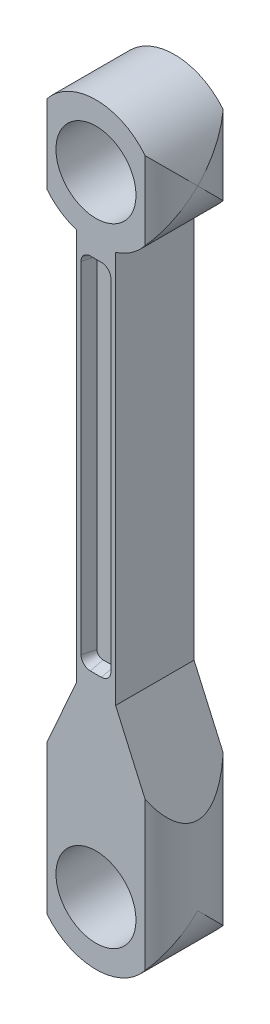
ISO-10303-21;
HEADER;
FILE_DESCRIPTION(('STEP AP214'),'2;1');
FILE_NAME('part.step','',(''),(''),'','','');
FILE_SCHEMA(('AUTOMOTIVE_DESIGN { 1 0 10303 214 1 1 1 1 }'));
ENDSEC;
DATA;
#1=APPLICATION_CONTEXT('core data for automotive mechanical design processes');
#2=APPLICATION_PROTOCOL_DEFINITION('international standard','automotive_design',2000,#1);
#3=PRODUCT_CONTEXT('',#1,'mechanical');
#4=PRODUCT('Part','Part','',(#3));
#5=PRODUCT_RELATED_PRODUCT_CATEGORY('part','',(#4));
#6=PRODUCT_DEFINITION_FORMATION('','',#4);
#7=PRODUCT_DEFINITION_CONTEXT('part definition',#1,'design');
#8=PRODUCT_DEFINITION('design','',#6,#7);
#9=PRODUCT_DEFINITION_SHAPE('','',#8);
#10=(LENGTH_UNIT() NAMED_UNIT(*) SI_UNIT(.MILLI.,.METRE.));
#11=(NAMED_UNIT(*) PLANE_ANGLE_UNIT() SI_UNIT($,.RADIAN.));
#12=(NAMED_UNIT(*) SI_UNIT($,.STERADIAN.) SOLID_ANGLE_UNIT());
#13=UNCERTAINTY_MEASURE_WITH_UNIT(LENGTH_MEASURE(1.E-05),#10,'distance_accuracy_value','');
#14=(GEOMETRIC_REPRESENTATION_CONTEXT(3) GLOBAL_UNCERTAINTY_ASSIGNED_CONTEXT((#13)) GLOBAL_UNIT_ASSIGNED_CONTEXT((#10,
#11,#12)) REPRESENTATION_CONTEXT('',''));
#15=CARTESIAN_POINT('',(0.,0.,0.));
#16=DIRECTION('',(0.,0.,1.));
#17=DIRECTION('',(1.,0.,0.));
#18=AXIS2_PLACEMENT_3D('',#15,#16,#17);
#19=CARTESIAN_POINT('',(0.,0.,12.7));
#20=DIRECTION('',(0.,0.,1.));
#21=DIRECTION('',(1.,0.,0.));
#22=AXIS2_PLACEMENT_3D('',#19,#20,#21);
#23=PLANE('',#22);
#24=CARTESIAN_POINT('',(-0.895446970962818,32.766,12.7));
#25=DIRECTION('',(0.,0.,1.));
#26=DIRECTION('',(1.,0.,0.));
#27=AXIS2_PLACEMENT_3D('',#24,#25,#26);
#28=CIRCLE('',#27,1.524);
#29=CARTESIAN_POINT('',(-2.41944697096282,32.766,12.7));
#30=VERTEX_POINT('',#29);
#31=CARTESIAN_POINT('',(-0.895446970962811,31.242,12.7));
#32=VERTEX_POINT('',#31);
#33=EDGE_CURVE('E323',#30,#32,#28,.T.);
#34=ORIENTED_EDGE('',*,*,#33,.F.);
#35=DIRECTION('',(0.,-1.,0.));
#36=VECTOR('',#35,1.);
#37=CARTESIAN_POINT('',(-2.41944697096282,87.884,12.7));
#38=LINE('',#37,#36);
#39=CARTESIAN_POINT('',(-2.41944697096282,87.884,12.7));
#40=VERTEX_POINT('',#39);
#41=EDGE_CURVE('E381',#40,#30,#38,.T.);
#42=ORIENTED_EDGE('',*,*,#41,.F.);
#43=CARTESIAN_POINT('',(-0.895446970962823,87.884,12.7));
#44=DIRECTION('',(0.,0.,1.));
#45=DIRECTION('',(1.,0.,0.));
#46=AXIS2_PLACEMENT_3D('',#43,#44,#45);
#47=CIRCLE('',#46,1.524);
#48=CARTESIAN_POINT('',(-0.895446970962823,89.408,12.7));
#49=VERTEX_POINT('',#48);
#50=EDGE_CURVE('E378',#49,#40,#47,.T.);
#51=ORIENTED_EDGE('',*,*,#50,.F.);
#52=DIRECTION('',(-1.,0.,0.));
#53=VECTOR('',#52,1.);
#54=CARTESIAN_POINT('',(-0.895446970962823,89.408,12.7));
#55=LINE('',#54,#53);
#56=CARTESIAN_POINT('',(0.895446970962823,89.408,12.7));
#57=VERTEX_POINT('',#56);
#58=EDGE_CURVE('E375',#57,#49,#55,.T.);
#59=ORIENTED_EDGE('',*,*,#58,.F.);
#60=CARTESIAN_POINT('',(0.895446970962823,87.884,12.7));
#61=DIRECTION('',(0.,0.,1.));
#62=DIRECTION('',(-1.,0.,0.));
#63=AXIS2_PLACEMENT_3D('',#60,#61,#62);
#64=CIRCLE('',#63,1.524);
#65=CARTESIAN_POINT('',(2.41944697096282,87.884,12.7));
#66=VERTEX_POINT('',#65);
#67=EDGE_CURVE('E372',#66,#57,#64,.T.);
#68=ORIENTED_EDGE('',*,*,#67,.F.);
#69=DIRECTION('',(0.,1.,0.));
#70=VECTOR('',#69,1.);
#71=CARTESIAN_POINT('',(2.41944697096282,87.884,12.7));
#72=LINE('',#71,#70);
#73=CARTESIAN_POINT('',(2.41944697096283,32.766,12.7));
#74=VERTEX_POINT('',#73);
#75=EDGE_CURVE('E369',#74,#66,#72,.T.);
#76=ORIENTED_EDGE('',*,*,#75,.F.);
#77=CARTESIAN_POINT('',(0.89544697096283,32.766,12.7));
#78=DIRECTION('',(0.,0.,1.));
#79=DIRECTION('',(1.,0.,0.));
#80=AXIS2_PLACEMENT_3D('',#77,#78,#79);
#81=CIRCLE('',#80,1.524);
#82=CARTESIAN_POINT('',(0.895446970962818,31.242,12.7));
#83=VERTEX_POINT('',#82);
#84=EDGE_CURVE('E366',#83,#74,#81,.T.);
#85=ORIENTED_EDGE('',*,*,#84,.F.);
#86=DIRECTION('',(1.,0.,0.));
#87=VECTOR('',#86,1.);
#88=CARTESIAN_POINT('',(-0.895446970962807,31.242,12.7));
#89=LINE('',#88,#87);
#90=EDGE_CURVE('E363',#32,#83,#89,.T.);
#91=ORIENTED_EDGE('',*,*,#90,.F.);
#92=EDGE_LOOP('',(#34,#42,#51,#59,#68,#76,#85,#91));
#93=FACE_BOUND('',#92,.T.);
#94=CARTESIAN_POINT('',(0.,0.,12.7));
#95=DIRECTION('',(0.,0.,1.));
#96=DIRECTION('',(1.,0.,0.));
#97=AXIS2_PLACEMENT_3D('',#94,#95,#96);
#98=CIRCLE('',#97,6.47699999999996);
#99=CARTESIAN_POINT('',(6.47699999999996,0.,12.7));
#100=VERTEX_POINT('',#99);
#101=EDGE_CURVE('E432',#100,#100,#98,.T.);
#102=ORIENTED_EDGE('',*,*,#101,.F.);
#103=EDGE_LOOP('',(#102));
#104=FACE_BOUND('',#103,.T.);
#105=CARTESIAN_POINT('',(0.,101.6,12.7));
#106=DIRECTION('',(0.,0.,1.));
#107=DIRECTION('',(1.,0.,0.));
#108=AXIS2_PLACEMENT_3D('',#105,#106,#107);
#109=CIRCLE('',#108,6.477);
#110=CARTESIAN_POINT('',(6.477,101.6,12.7));
#111=VERTEX_POINT('',#110);
#112=EDGE_CURVE('E426',#111,#111,#109,.T.);
#113=ORIENTED_EDGE('',*,*,#112,.F.);
#114=EDGE_LOOP('',(#113));
#115=FACE_BOUND('',#114,.T.);
#116=CARTESIAN_POINT('',(0.,0.,12.7));
#117=DIRECTION('',(0.,0.,1.));
#118=DIRECTION('',(1.,0.,0.));
#119=AXIS2_PLACEMENT_3D('',#116,#117,#118);
#120=CIRCLE('',#119,10.16);
#121=CARTESIAN_POINT('',(-7.96171854377689,-6.31162719349607,12.7));
#122=VERTEX_POINT('',#121);
#123=CARTESIAN_POINT('',(7.96171854377688,-6.31162719349609,12.7));
#124=VERTEX_POINT('',#123);
#125=EDGE_CURVE('E249',#122,#124,#120,.T.);
#126=ORIENTED_EDGE('',*,*,#125,.T.);
#127=DIRECTION('',(0.,1.,0.));
#128=VECTOR('',#127,1.);
#129=CARTESIAN_POINT('',(7.96171854377688,-10.16,12.7));
#130=LINE('',#129,#128);
#131=CARTESIAN_POINT('',(7.96171854377688,17.6607040640885,12.7));
#132=VERTEX_POINT('',#131);
#133=EDGE_CURVE('E256',#124,#132,#130,.T.);
#134=ORIENTED_EDGE('',*,*,#133,.T.);
#135=DIRECTION('',(-0.405141586779863,0.914253955234263,0.));
#136=VECTOR('',#135,1.);
#137=CARTESIAN_POINT('',(10.16,12.7,12.7));
#138=LINE('',#137,#136);
#139=CARTESIAN_POINT('',(3.18144697096282,28.448,12.7));
#140=VERTEX_POINT('',#139);
#141=EDGE_CURVE('E439',#132,#140,#138,.T.);
#142=ORIENTED_EDGE('',*,*,#141,.T.);
#143=DIRECTION('',(0.,1.,0.));
#144=VECTOR('',#143,1.);
#145=CARTESIAN_POINT('',(3.18144697096282,28.448,12.7));
#146=LINE('',#145,#144);
#147=CARTESIAN_POINT('',(3.18144697096282,91.9509588470692,12.7));
#148=VERTEX_POINT('',#147);
#149=EDGE_CURVE('E442',#140,#148,#146,.T.);
#150=ORIENTED_EDGE('',*,*,#149,.T.);
#151=CARTESIAN_POINT('',(0.,101.6,12.7));
#152=DIRECTION('',(0.,0.,1.));
#153=DIRECTION('',(1.,0.,0.));
#154=AXIS2_PLACEMENT_3D('',#151,#152,#153);
#155=CIRCLE('',#154,10.16);
#156=CARTESIAN_POINT('',(7.96171854377688,95.2883728065039,12.7));
#157=VERTEX_POINT('',#156);
#158=EDGE_CURVE('E445',#148,#157,#155,.T.);
#159=ORIENTED_EDGE('',*,*,#158,.T.);
#160=CARTESIAN_POINT('',(7.96171854377688,107.911627193496,12.7));
#161=VERTEX_POINT('',#160);
#162=EDGE_CURVE('E58',#157,#161,#130,.T.);
#163=ORIENTED_EDGE('',*,*,#162,.T.);
#164=CARTESIAN_POINT('',(-7.96171854377688,107.911627193496,12.7));
#165=VERTEX_POINT('',#164);
#166=EDGE_CURVE('E448',#161,#165,#155,.T.);
#167=ORIENTED_EDGE('',*,*,#166,.T.);
#168=DIRECTION('',(0.,1.,0.));
#169=VECTOR('',#168,1.);
#170=CARTESIAN_POINT('',(-7.96171854377688,-10.16,12.7));
#171=LINE('',#170,#169);
#172=CARTESIAN_POINT('',(-7.96171854377688,95.2883728065039,12.7));
#173=VERTEX_POINT('',#172);
#174=EDGE_CURVE('E283',#165,#173,#171,.F.);
#175=ORIENTED_EDGE('',*,*,#174,.T.);
#176=CARTESIAN_POINT('',(-3.18144697096282,91.9509588470692,12.7));
#177=VERTEX_POINT('',#176);
#178=EDGE_CURVE('E444',#173,#177,#155,.T.);
#179=ORIENTED_EDGE('',*,*,#178,.T.);
#180=DIRECTION('',(0.,-1.,0.));
#181=VECTOR('',#180,1.);
#182=CARTESIAN_POINT('',(-3.18144697096282,28.448,12.7));
#183=LINE('',#182,#181);
#184=CARTESIAN_POINT('',(-3.18144697096282,28.448,12.7));
#185=VERTEX_POINT('',#184);
#186=EDGE_CURVE('E447',#177,#185,#183,.T.);
#187=ORIENTED_EDGE('',*,*,#186,.T.);
#188=DIRECTION('',(-0.405141586779863,-0.914253955234263,0.));
#189=VECTOR('',#188,1.);
#190=CARTESIAN_POINT('',(-10.16,12.7,12.7));
#191=LINE('',#190,#189);
#192=CARTESIAN_POINT('',(-7.96171854377688,17.6607040640885,12.7));
#193=VERTEX_POINT('',#192);
#194=EDGE_CURVE('E450',#185,#193,#191,.T.);
#195=ORIENTED_EDGE('',*,*,#194,.T.);
#196=EDGE_CURVE('E252',#193,#122,#171,.F.);
#197=ORIENTED_EDGE('',*,*,#196,.T.);
#198=EDGE_LOOP('',(#126,#134,#142,#150,#159,#163,#167,#175,#179,#187,#195,#197));
#199=FACE_BOUND('',#198,.T.);
#200=ADVANCED_FACE('F35',(#93,#104,#115,#199),#23,.T.);
#201=CARTESIAN_POINT('',(0.,0.,0.));
#202=DIRECTION('',(0.,0.,1.));
#203=DIRECTION('',(1.,0.,0.));
#204=AXIS2_PLACEMENT_3D('',#201,#202,#203);
#205=PLANE('',#204);
#206=DIRECTION('',(-1.,0.,0.));
#207=VECTOR('',#206,1.);
#208=CARTESIAN_POINT('',(0.895446970962805,31.242,0.));
#209=LINE('',#208,#207);
#210=CARTESIAN_POINT('',(0.895446970962809,31.242,0.));
#211=VERTEX_POINT('',#210);
#212=CARTESIAN_POINT('',(-0.895446970962819,31.242,0.));
#213=VERTEX_POINT('',#212);
#214=EDGE_CURVE('E299',#211,#213,#209,.T.);
#215=ORIENTED_EDGE('',*,*,#214,.F.);
#216=CARTESIAN_POINT('',(0.895446970962816,32.766,0.));
#217=DIRECTION('',(0.,0.,-1.));
#218=DIRECTION('',(-1.,0.,0.));
#219=AXIS2_PLACEMENT_3D('',#216,#217,#218);
#220=CIRCLE('',#219,1.524);
#221=CARTESIAN_POINT('',(2.41944697096282,32.766,0.));
#222=VERTEX_POINT('',#221);
#223=EDGE_CURVE('E259',#222,#211,#220,.T.);
#224=ORIENTED_EDGE('',*,*,#223,.F.);
#225=DIRECTION('',(0.,-1.,0.));
#226=VECTOR('',#225,1.);
#227=CARTESIAN_POINT('',(2.41944697096282,87.884,0.));
#228=LINE('',#227,#226);
#229=CARTESIAN_POINT('',(2.41944697096282,87.884,0.));
#230=VERTEX_POINT('',#229);
#231=EDGE_CURVE('E317',#230,#222,#228,.T.);
#232=ORIENTED_EDGE('',*,*,#231,.F.);
#233=CARTESIAN_POINT('',(0.895446970962823,87.884,0.));
#234=DIRECTION('',(0.,0.,-1.));
#235=DIRECTION('',(-1.,0.,0.));
#236=AXIS2_PLACEMENT_3D('',#233,#234,#235);
#237=CIRCLE('',#236,1.524);
#238=CARTESIAN_POINT('',(0.895446970962812,89.408,0.));
#239=VERTEX_POINT('',#238);
#240=EDGE_CURVE('E314',#239,#230,#237,.T.);
#241=ORIENTED_EDGE('',*,*,#240,.F.);
#242=DIRECTION('',(1.,0.,0.));
#243=VECTOR('',#242,1.);
#244=CARTESIAN_POINT('',(0.895446970962812,89.408,0.));
#245=LINE('',#244,#243);
#246=CARTESIAN_POINT('',(-0.895446970962813,89.408,0.));
#247=VERTEX_POINT('',#246);
#248=EDGE_CURVE('E311',#247,#239,#245,.T.);
#249=ORIENTED_EDGE('',*,*,#248,.F.);
#250=CARTESIAN_POINT('',(-0.895446970962824,87.884,0.));
#251=DIRECTION('',(0.,0.,-1.));
#252=DIRECTION('',(1.,0.,0.));
#253=AXIS2_PLACEMENT_3D('',#250,#251,#252);
#254=CIRCLE('',#253,1.524);
#255=CARTESIAN_POINT('',(-2.41944697096282,87.884,0.));
#256=VERTEX_POINT('',#255);
#257=EDGE_CURVE('E308',#256,#247,#254,.T.);
#258=ORIENTED_EDGE('',*,*,#257,.F.);
#259=DIRECTION('',(0.,1.,0.));
#260=VECTOR('',#259,1.);
#261=CARTESIAN_POINT('',(-2.41944697096282,87.884,0.));
#262=LINE('',#261,#260);
#263=CARTESIAN_POINT('',(-2.41944697096283,32.766,0.));
#264=VERTEX_POINT('',#263);
#265=EDGE_CURVE('E305',#264,#256,#262,.T.);
#266=ORIENTED_EDGE('',*,*,#265,.F.);
#267=CARTESIAN_POINT('',(-0.89544697096283,32.766,0.));
#268=DIRECTION('',(0.,0.,-1.));
#269=DIRECTION('',(-1.,0.,0.));
#270=AXIS2_PLACEMENT_3D('',#267,#268,#269);
#271=CIRCLE('',#270,1.524);
#272=EDGE_CURVE('E302',#213,#264,#271,.T.);
#273=ORIENTED_EDGE('',*,*,#272,.F.);
#274=EDGE_LOOP('',(#215,#224,#232,#241,#249,#258,#266,#273));
#275=FACE_BOUND('',#274,.T.);
#276=CARTESIAN_POINT('',(0.,0.,0.));
#277=DIRECTION('',(0.,0.,1.));
#278=DIRECTION('',(1.,0.,0.));
#279=AXIS2_PLACEMENT_3D('',#276,#277,#278);
#280=CIRCLE('',#279,6.47699999999996);
#281=CARTESIAN_POINT('',(6.47699999999996,0.,0.));
#282=VERTEX_POINT('',#281);
#283=EDGE_CURVE('E429',#282,#282,#280,.T.);
#284=ORIENTED_EDGE('',*,*,#283,.T.);
#285=EDGE_LOOP('',(#284));
#286=FACE_BOUND('',#285,.T.);
#287=CARTESIAN_POINT('',(0.,101.6,0.));
#288=DIRECTION('',(0.,0.,1.));
#289=DIRECTION('',(1.,0.,0.));
#290=AXIS2_PLACEMENT_3D('',#287,#288,#289);
#291=CIRCLE('',#290,6.477);
#292=CARTESIAN_POINT('',(6.477,101.6,0.));
#293=VERTEX_POINT('',#292);
#294=EDGE_CURVE('E387',#293,#293,#291,.T.);
#295=ORIENTED_EDGE('',*,*,#294,.T.);
#296=EDGE_LOOP('',(#295));
#297=FACE_BOUND('',#296,.T.);
#298=DIRECTION('',(0.,1.,0.));
#299=VECTOR('',#298,1.);
#300=CARTESIAN_POINT('',(7.90027169691782,-10.16,0.));
#301=LINE('',#300,#299);
#302=CARTESIAN_POINT('',(7.90027169691782,-6.38837280650396,0.));
#303=VERTEX_POINT('',#302);
#304=CARTESIAN_POINT('',(7.90027169691782,17.7993667553814,0.));
#305=VERTEX_POINT('',#304);
#306=EDGE_CURVE('E261',#303,#305,#301,.T.);
#307=ORIENTED_EDGE('',*,*,#306,.F.);
#308=CARTESIAN_POINT('',(0.,0.,0.));
#309=DIRECTION('',(0.,0.,1.));
#310=DIRECTION('',(1.,0.,0.));
#311=AXIS2_PLACEMENT_3D('',#308,#309,#310);
#312=CIRCLE('',#311,10.16);
#313=CARTESIAN_POINT('',(-7.90027169691782,-6.38837280650396,0.));
#314=VERTEX_POINT('',#313);
#315=EDGE_CURVE('E435',#314,#303,#312,.T.);
#316=ORIENTED_EDGE('',*,*,#315,.F.);
#317=DIRECTION('',(0.,1.,0.));
#318=VECTOR('',#317,1.);
#319=CARTESIAN_POINT('',(-7.90027169691782,-10.16,0.));
#320=LINE('',#319,#318);
#321=CARTESIAN_POINT('',(-7.90027169691782,17.7993667553814,0.));
#322=VERTEX_POINT('',#321);
#323=EDGE_CURVE('E238',#322,#314,#320,.F.);
#324=ORIENTED_EDGE('',*,*,#323,.F.);
#325=DIRECTION('',(-0.405141586779863,-0.914253955234263,0.));
#326=VECTOR('',#325,1.);
#327=CARTESIAN_POINT('',(-10.16,12.7,0.));
#328=LINE('',#327,#326);
#329=CARTESIAN_POINT('',(-3.18144697096282,28.448,0.));
#330=VERTEX_POINT('',#329);
#331=EDGE_CURVE('E440',#330,#322,#328,.T.);
#332=ORIENTED_EDGE('',*,*,#331,.F.);
#333=DIRECTION('',(0.,-1.,0.));
#334=VECTOR('',#333,1.);
#335=CARTESIAN_POINT('',(-3.18144697096282,28.448,0.));
#336=LINE('',#335,#334);
#337=CARTESIAN_POINT('',(-3.18144697096282,91.9509588470692,0.));
#338=VERTEX_POINT('',#337);
#339=EDGE_CURVE('E462',#338,#330,#336,.T.);
#340=ORIENTED_EDGE('',*,*,#339,.F.);
#341=CARTESIAN_POINT('',(0.,101.6,0.));
#342=DIRECTION('',(0.,0.,1.));
#343=DIRECTION('',(1.,0.,0.));
#344=AXIS2_PLACEMENT_3D('',#341,#342,#343);
#345=CIRCLE('',#344,10.16);
#346=CARTESIAN_POINT('',(-7.90027169691782,95.2116271934961,0.));
#347=VERTEX_POINT('',#346);
#348=EDGE_CURVE('E458',#347,#338,#345,.T.);
#349=ORIENTED_EDGE('',*,*,#348,.F.);
#350=CARTESIAN_POINT('',(-7.90027169691782,107.988372806504,0.));
#351=VERTEX_POINT('',#350);
#352=EDGE_CURVE('E254',#351,#347,#320,.F.);
#353=ORIENTED_EDGE('',*,*,#352,.F.);
#354=CARTESIAN_POINT('',(7.90027169691782,107.988372806504,0.));
#355=VERTEX_POINT('',#354);
#356=EDGE_CURVE('E463',#355,#351,#345,.T.);
#357=ORIENTED_EDGE('',*,*,#356,.F.);
#358=CARTESIAN_POINT('',(7.90027169691782,95.2116271934961,0.));
#359=VERTEX_POINT('',#358);
#360=EDGE_CURVE('E267',#359,#355,#301,.T.);
#361=ORIENTED_EDGE('',*,*,#360,.F.);
#362=CARTESIAN_POINT('',(3.18144697096282,91.9509588470692,0.));
#363=VERTEX_POINT('',#362);
#364=EDGE_CURVE('E459',#363,#359,#345,.T.);
#365=ORIENTED_EDGE('',*,*,#364,.F.);
#366=DIRECTION('',(0.,1.,0.));
#367=VECTOR('',#366,1.);
#368=CARTESIAN_POINT('',(3.18144697096282,28.448,0.));
#369=LINE('',#368,#367);
#370=CARTESIAN_POINT('',(3.18144697096282,28.448,0.));
#371=VERTEX_POINT('',#370);
#372=EDGE_CURVE('E456',#371,#363,#369,.T.);
#373=ORIENTED_EDGE('',*,*,#372,.F.);
#374=DIRECTION('',(-0.405141586779863,0.914253955234263,0.));
#375=VECTOR('',#374,1.);
#376=CARTESIAN_POINT('',(10.16,12.7,0.));
#377=LINE('',#376,#375);
#378=EDGE_CURVE('E454',#305,#371,#377,.T.);
#379=ORIENTED_EDGE('',*,*,#378,.F.);
#380=EDGE_LOOP('',(#307,#316,#324,#332,#340,#349,#353,#357,#361,#365,#373,#379));
#381=FACE_BOUND('',#380,.T.);
#382=ADVANCED_FACE('F483',(#275,#286,#297,#381),#205,.F.);
#383=CARTESIAN_POINT('',(0.,0.,12.7));
#384=DIRECTION('',(0.,0.,-1.));
#385=DIRECTION('',(-1.,0.,0.));
#386=AXIS2_PLACEMENT_3D('',#383,#384,#385);
#387=CYLINDRICAL_SURFACE('',#386,10.16);
#388=CARTESIAN_POINT('',(0.,0.,6.38837280650393));
#389=DIRECTION('',(0.,0.707106781186547,-0.707106781186547));
#390=DIRECTION('',(0.,-0.707106781186547,-0.707106781186547));
#391=AXIS2_PLACEMENT_3D('',#388,#389,#390);
#392=ELLIPSE('',#391,14.3684097937106,10.16);
#393=CARTESIAN_POINT('',(-10.16,0.,6.38837280650393));
#394=VERTEX_POINT('',#393);
#395=EDGE_CURVE('E232',#314,#394,#392,.T.);
#396=ORIENTED_EDGE('',*,*,#395,.F.);
#397=ORIENTED_EDGE('',*,*,#315,.T.);
#398=CARTESIAN_POINT('',(10.16,0.,6.38837280650393));
#399=VERTEX_POINT('',#398);
#400=EDGE_CURVE('E245',#399,#303,#392,.T.);
#401=ORIENTED_EDGE('',*,*,#400,.F.);
#402=CARTESIAN_POINT('',(0.,0.,6.38837280650393));
#403=DIRECTION('',(0.,-0.707106781186547,-0.707106781186547));
#404=DIRECTION('',(0.,0.707106781186547,-0.707106781186547));
#405=AXIS2_PLACEMENT_3D('',#402,#403,#404);
#406=ELLIPSE('',#405,14.3684097937106,10.16);
#407=EDGE_CURVE('E251',#124,#399,#406,.F.);
#408=ORIENTED_EDGE('',*,*,#407,.F.);
#409=ORIENTED_EDGE('',*,*,#125,.F.);
#410=EDGE_CURVE('E235',#394,#122,#406,.F.);
#411=ORIENTED_EDGE('',*,*,#410,.F.);
#412=EDGE_LOOP('',(#396,#397,#401,#408,#409,#411));
#413=FACE_BOUND('',#412,.T.);
#414=ADVANCED_FACE('F37',(#413),#387,.T.);
#415=CARTESIAN_POINT('',(10.16,12.7,12.7));
#416=DIRECTION('',(-0.914253955234263,-0.405141586779863,0.));
#417=DIRECTION('',(0.405141586779863,-0.914253955234264,0.));
#418=AXIS2_PLACEMENT_3D('',#415,#416,#417);
#419=PLANE('',#418);
#420=CARTESIAN_POINT('',(0.,35.6273431518331,6.38837280650393));
#421=DIRECTION('',(-0.914253955234263,-0.405141586779863,0.));
#422=DIRECTION('',(-0.405141586779863,0.914253955234263,0.));
#423=AXIS2_PLACEMENT_3D('',#420,#421,#422);
#424=ELLIPSE('',#423,25.07765268126,10.16);
#425=EDGE_CURVE('E265',#305,#132,#424,.T.);
#426=ORIENTED_EDGE('',*,*,#425,.F.);
#427=ORIENTED_EDGE('',*,*,#378,.T.);
#428=DIRECTION('',(0.,0.,-1.));
#429=VECTOR('',#428,1.);
#430=CARTESIAN_POINT('',(3.18144697096282,28.448,12.7));
#431=LINE('',#430,#429);
#432=EDGE_CURVE('E11',#140,#371,#431,.T.);
#433=ORIENTED_EDGE('',*,*,#432,.F.);
#434=ORIENTED_EDGE('',*,*,#141,.F.);
#435=EDGE_LOOP('',(#426,#427,#433,#434));
#436=FACE_BOUND('',#435,.T.);
#437=ADVANCED_FACE('F508',(#436),#419,.F.);
#438=CARTESIAN_POINT('',(0.,101.6,12.7));
#439=DIRECTION('',(0.,0.,-1.));
#440=DIRECTION('',(-1.,0.,0.));
#441=AXIS2_PLACEMENT_3D('',#438,#439,#440);
#442=CYLINDRICAL_SURFACE('',#441,10.16);
#443=CARTESIAN_POINT('',(0.,101.6,6.38837280650393));
#444=DIRECTION('',(0.,0.707106781186547,-0.707106781186547));
#445=DIRECTION('',(0.,-0.707106781186547,-0.707106781186547));
#446=AXIS2_PLACEMENT_3D('',#443,#444,#445);
#447=ELLIPSE('',#446,14.3684097937106,10.16);
#448=CARTESIAN_POINT('',(10.16,101.6,6.38837280650393));
#449=VERTEX_POINT('',#448);
#450=EDGE_CURVE('E273',#449,#161,#447,.F.);
#451=ORIENTED_EDGE('',*,*,#450,.F.);
#452=CARTESIAN_POINT('',(0.,101.6,6.38837280650393));
#453=DIRECTION('',(0.,-0.707106781186547,-0.707106781186547));
#454=DIRECTION('',(0.,0.707106781186547,-0.707106781186547));
#455=AXIS2_PLACEMENT_3D('',#452,#453,#454);
#456=ELLIPSE('',#455,14.3684097937106,10.16);
#457=EDGE_CURVE('E274',#355,#449,#456,.T.);
#458=ORIENTED_EDGE('',*,*,#457,.F.);
#459=ORIENTED_EDGE('',*,*,#356,.T.);
#460=CARTESIAN_POINT('',(-10.16,101.6,6.38837280650393));
#461=VERTEX_POINT('',#460);
#462=EDGE_CURVE('E279',#461,#351,#456,.T.);
#463=ORIENTED_EDGE('',*,*,#462,.F.);
#464=EDGE_CURVE('E287',#165,#461,#447,.F.);
#465=ORIENTED_EDGE('',*,*,#464,.F.);
#466=ORIENTED_EDGE('',*,*,#166,.F.);
#467=EDGE_LOOP('',(#451,#458,#459,#463,#465,#466));
#468=FACE_BOUND('',#467,.T.);
#469=ADVANCED_FACE('F502',(#468),#442,.T.);
#470=CARTESIAN_POINT('',(0.,101.6,6.38837280650393));
#471=DIRECTION('',(0.,0.707106781186547,-0.707106781186547));
#472=DIRECTION('',(0.,-0.707106781186547,-0.707106781186547));
#473=AXIS2_PLACEMENT_3D('',#470,#471,#472);
#474=ELLIPSE('',#473,14.3684097937106,10.16);
#475=EDGE_CURVE('E269',#449,#359,#474,.T.);
#476=ORIENTED_EDGE('',*,*,#475,.F.);
#477=CARTESIAN_POINT('',(0.,101.6,6.38837280650393));
#478=DIRECTION('',(0.,-0.707106781186547,-0.707106781186547));
#479=DIRECTION('',(0.,0.707106781186547,-0.707106781186547));
#480=AXIS2_PLACEMENT_3D('',#477,#478,#479);
#481=ELLIPSE('',#480,14.3684097937106,10.16);
#482=EDGE_CURVE('E242',#157,#449,#481,.F.);
#483=ORIENTED_EDGE('',*,*,#482,.F.);
#484=ORIENTED_EDGE('',*,*,#158,.F.);
#485=DIRECTION('',(0.,0.,-1.));
#486=VECTOR('',#485,1.);
#487=CARTESIAN_POINT('',(3.18144697096282,91.9509588470692,12.7));
#488=LINE('',#487,#486);
#489=EDGE_CURVE('E43',#148,#363,#488,.T.);
#490=ORIENTED_EDGE('',*,*,#489,.T.);
#491=ORIENTED_EDGE('',*,*,#364,.T.);
#492=EDGE_LOOP('',(#476,#483,#484,#490,#491));
#493=FACE_BOUND('',#492,.T.);
#494=ADVANCED_FACE('F477',(#493),#442,.T.);
#495=EDGE_CURVE('E50',#347,#461,#474,.T.);
#496=ORIENTED_EDGE('',*,*,#495,.F.);
#497=ORIENTED_EDGE('',*,*,#348,.T.);
#498=DIRECTION('',(0.,0.,-1.));
#499=VECTOR('',#498,1.);
#500=CARTESIAN_POINT('',(-3.18144697096282,91.9509588470692,12.7));
#501=LINE('',#500,#499);
#502=EDGE_CURVE('E469',#177,#338,#501,.T.);
#503=ORIENTED_EDGE('',*,*,#502,.F.);
#504=ORIENTED_EDGE('',*,*,#178,.F.);
#505=EDGE_CURVE('E281',#461,#173,#481,.F.);
#506=ORIENTED_EDGE('',*,*,#505,.F.);
#507=EDGE_LOOP('',(#496,#497,#503,#504,#506));
#508=FACE_BOUND('',#507,.T.);
#509=ADVANCED_FACE('F491',(#508),#442,.T.);
#510=CARTESIAN_POINT('',(-10.16,12.7,12.7));
#511=DIRECTION('',(0.914253955234263,-0.405141586779863,0.));
#512=DIRECTION('',(0.405141586779863,0.914253955234264,0.));
#513=AXIS2_PLACEMENT_3D('',#510,#511,#512);
#514=PLANE('',#513);
#515=CARTESIAN_POINT('',(0.,35.6273431518331,6.38837280650393));
#516=DIRECTION('',(0.914253955234263,-0.405141586779863,0.));
#517=DIRECTION('',(0.405141586779863,0.914253955234263,0.));
#518=AXIS2_PLACEMENT_3D('',#515,#516,#517);
#519=ELLIPSE('',#518,25.07765268126,10.16);
#520=EDGE_CURVE('E243',#193,#322,#519,.T.);
#521=ORIENTED_EDGE('',*,*,#520,.F.);
#522=ORIENTED_EDGE('',*,*,#194,.F.);
#523=DIRECTION('',(0.,0.,-1.));
#524=VECTOR('',#523,1.);
#525=CARTESIAN_POINT('',(-3.18144697096282,28.448,12.7));
#526=LINE('',#525,#524);
#527=EDGE_CURVE('E452',#185,#330,#526,.T.);
#528=ORIENTED_EDGE('',*,*,#527,.T.);
#529=ORIENTED_EDGE('',*,*,#331,.T.);
#530=EDGE_LOOP('',(#521,#522,#528,#529));
#531=FACE_BOUND('',#530,.T.);
#532=ADVANCED_FACE('F500',(#531),#514,.F.);
#533=CARTESIAN_POINT('',(3.18144697096282,28.448,12.7));
#534=DIRECTION('',(-1.,0.,0.));
#535=DIRECTION('',(0.,0.,1.));
#536=AXIS2_PLACEMENT_3D('',#533,#534,#535);
#537=PLANE('',#536);
#538=ORIENTED_EDGE('',*,*,#372,.T.);
#539=ORIENTED_EDGE('',*,*,#489,.F.);
#540=ORIENTED_EDGE('',*,*,#149,.F.);
#541=ORIENTED_EDGE('',*,*,#432,.T.);
#542=EDGE_LOOP('',(#538,#539,#540,#541));
#543=FACE_BOUND('',#542,.T.);
#544=ADVANCED_FACE('F506',(#543),#537,.F.);
#545=CARTESIAN_POINT('',(-3.18144697096282,28.448,12.7));
#546=DIRECTION('',(1.,0.,0.));
#547=DIRECTION('',(0.,0.,-1.));
#548=AXIS2_PLACEMENT_3D('',#545,#546,#547);
#549=PLANE('',#548);
#550=ORIENTED_EDGE('',*,*,#339,.T.);
#551=ORIENTED_EDGE('',*,*,#527,.F.);
#552=ORIENTED_EDGE('',*,*,#186,.F.);
#553=ORIENTED_EDGE('',*,*,#502,.T.);
#554=EDGE_LOOP('',(#550,#551,#552,#553));
#555=FACE_BOUND('',#554,.T.);
#556=ADVANCED_FACE('F495',(#555),#549,.F.);
#557=CARTESIAN_POINT('',(0.,0.,12.7));
#558=DIRECTION('',(0.,0.,-1.));
#559=DIRECTION('',(-1.,0.,0.));
#560=AXIS2_PLACEMENT_3D('',#557,#558,#559);
#561=CYLINDRICAL_SURFACE('',#560,6.47699999999996);
#562=ORIENTED_EDGE('',*,*,#101,.T.);
#563=EDGE_LOOP('',(#562));
#564=FACE_BOUND('',#563,.T.);
#565=ORIENTED_EDGE('',*,*,#283,.F.);
#566=EDGE_LOOP('',(#565));
#567=FACE_BOUND('',#566,.T.);
#568=ADVANCED_FACE('F532',(#564,#567),#561,.F.);
#569=CARTESIAN_POINT('',(0.,101.6,12.7));
#570=DIRECTION('',(0.,0.,-1.));
#571=DIRECTION('',(-1.,0.,0.));
#572=AXIS2_PLACEMENT_3D('',#569,#570,#571);
#573=CYLINDRICAL_SURFACE('',#572,6.477);
#574=ORIENTED_EDGE('',*,*,#112,.T.);
#575=EDGE_LOOP('',(#574));
#576=FACE_BOUND('',#575,.T.);
#577=ORIENTED_EDGE('',*,*,#294,.F.);
#578=EDGE_LOOP('',(#577));
#579=FACE_BOUND('',#578,.T.);
#580=ADVANCED_FACE('F736',(#576,#579),#573,.F.);
#581=CARTESIAN_POINT('',(-0.895446970962818,32.766,12.7));
#582=DIRECTION('',(0.,0.,1.));
#583=DIRECTION('',(1.,0.,0.));
#584=AXIS2_PLACEMENT_3D('',#581,#582,#583);
#585=CONICAL_SURFACE('',#584,1.524,0.26179938779915);
#586=ORIENTED_EDGE('',*,*,#33,.T.);
#587=DIRECTION('',(0.,-0.258819045102521,0.965925826289068));
#588=VECTOR('',#587,1.);
#589=CARTESIAN_POINT('',(-0.895446970962807,31.242,12.7));
#590=LINE('',#589,#588);
#591=CARTESIAN_POINT('',(-0.895446970962811,31.78647275902,10.668));
#592=VERTEX_POINT('',#591);
#593=EDGE_CURVE('E389',#592,#32,#590,.T.);
#594=ORIENTED_EDGE('',*,*,#593,.F.);
#595=CARTESIAN_POINT('',(-0.895446970962818,32.766,10.668));
#596=DIRECTION('',(0.,0.,1.));
#597=DIRECTION('',(1.,0.,0.));
#598=AXIS2_PLACEMENT_3D('',#595,#596,#597);
#599=CIRCLE('',#598,0.979527240979958);
#600=CARTESIAN_POINT('',(-1.87497421194278,32.766,10.668));
#601=VERTEX_POINT('',#600);
#602=EDGE_CURVE('E384',#601,#592,#599,.T.);
#603=ORIENTED_EDGE('',*,*,#602,.F.);
#604=DIRECTION('',(-0.258819045102521,0.,0.965925826289068));
#605=VECTOR('',#604,1.);
#606=CARTESIAN_POINT('',(-2.41944697096282,32.766,12.7));
#607=LINE('',#606,#605);
#608=EDGE_CURVE('E385',#601,#30,#607,.T.);
#609=ORIENTED_EDGE('',*,*,#608,.T.);
#610=EDGE_LOOP('',(#586,#594,#603,#609));
#611=FACE_BOUND('',#610,.T.);
#612=ADVANCED_FACE('F726',(#611),#585,.F.);
#613=CARTESIAN_POINT('',(-2.41944697096282,87.884,12.7));
#614=DIRECTION('',(-0.965925826289068,0.,-0.258819045102521));
#615=DIRECTION('',(-0.258819045102521,0.,0.965925826289068));
#616=AXIS2_PLACEMENT_3D('',#613,#614,#615);
#617=PLANE('',#616);
#618=ORIENTED_EDGE('',*,*,#41,.T.);
#619=ORIENTED_EDGE('',*,*,#608,.F.);
#620=DIRECTION('',(0.,-1.,0.));
#621=VECTOR('',#620,1.);
#622=CARTESIAN_POINT('',(-1.87497421194278,32.766,10.668));
#623=LINE('',#622,#621);
#624=CARTESIAN_POINT('',(-1.87497421194278,87.884,10.668));
#625=VERTEX_POINT('',#624);
#626=EDGE_CURVE('E393',#625,#601,#623,.T.);
#627=ORIENTED_EDGE('',*,*,#626,.F.);
#628=DIRECTION('',(-0.258819045102521,0.,0.965925826289068));
#629=VECTOR('',#628,1.);
#630=CARTESIAN_POINT('',(-2.41944697096282,87.884,12.7));
#631=LINE('',#630,#629);
#632=EDGE_CURVE('E388',#625,#40,#631,.T.);
#633=ORIENTED_EDGE('',*,*,#632,.T.);
#634=EDGE_LOOP('',(#618,#619,#627,#633));
#635=FACE_BOUND('',#634,.T.);
#636=ADVANCED_FACE('F716',(#635),#617,.F.);
#637=CARTESIAN_POINT('',(-0.895446970962823,87.884,12.7));
#638=DIRECTION('',(0.,0.,1.));
#639=DIRECTION('',(1.,0.,0.));
#640=AXIS2_PLACEMENT_3D('',#637,#638,#639);
#641=CONICAL_SURFACE('',#640,1.524,0.26179938779915);
#642=ORIENTED_EDGE('',*,*,#50,.T.);
#643=ORIENTED_EDGE('',*,*,#632,.F.);
#644=CARTESIAN_POINT('',(-0.895446970962823,87.884,10.668));
#645=DIRECTION('',(0.,0.,1.));
#646=DIRECTION('',(1.,0.,0.));
#647=AXIS2_PLACEMENT_3D('',#644,#645,#646);
#648=CIRCLE('',#647,0.979527240979956);
#649=CARTESIAN_POINT('',(-0.895446970962823,88.86352724098,10.668));
#650=VERTEX_POINT('',#649);
#651=EDGE_CURVE('E409',#650,#625,#648,.T.);
#652=ORIENTED_EDGE('',*,*,#651,.F.);
#653=DIRECTION('',(0.,0.258819045102521,0.965925826289068));
#654=VECTOR('',#653,1.);
#655=CARTESIAN_POINT('',(-0.895446970962823,89.408,12.7));
#656=LINE('',#655,#654);
#657=EDGE_CURVE('E401',#650,#49,#656,.T.);
#658=ORIENTED_EDGE('',*,*,#657,.T.);
#659=EDGE_LOOP('',(#642,#643,#652,#658));
#660=FACE_BOUND('',#659,.T.);
#661=ADVANCED_FACE('F706',(#660),#641,.F.);
#662=CARTESIAN_POINT('',(-0.895446970962823,89.408,12.7));
#663=DIRECTION('',(0.,0.965925826289068,-0.258819045102521));
#664=DIRECTION('',(0.,0.258819045102521,0.965925826289068));
#665=AXIS2_PLACEMENT_3D('',#662,#663,#664);
#666=PLANE('',#665);
#667=ORIENTED_EDGE('',*,*,#58,.T.);
#668=ORIENTED_EDGE('',*,*,#657,.F.);
#669=DIRECTION('',(-1.,0.,0.));
#670=VECTOR('',#669,1.);
#671=CARTESIAN_POINT('',(-0.895446970962818,88.86352724098,10.668));
#672=LINE('',#671,#670);
#673=CARTESIAN_POINT('',(0.895446970962823,88.86352724098,10.668));
#674=VERTEX_POINT('',#673);
#675=EDGE_CURVE('E412',#674,#650,#672,.T.);
#676=ORIENTED_EDGE('',*,*,#675,.F.);
#677=DIRECTION('',(0.,0.258819045102521,0.965925826289068));
#678=VECTOR('',#677,1.);
#679=CARTESIAN_POINT('',(0.895446970962824,89.408,12.7));
#680=LINE('',#679,#678);
#681=EDGE_CURVE('E399',#674,#57,#680,.T.);
#682=ORIENTED_EDGE('',*,*,#681,.T.);
#683=EDGE_LOOP('',(#667,#668,#676,#682));
#684=FACE_BOUND('',#683,.T.);
#685=ADVANCED_FACE('F696',(#684),#666,.F.);
#686=CARTESIAN_POINT('',(0.895446970962823,87.884,12.7));
#687=DIRECTION('',(0.,0.,1.));
#688=DIRECTION('',(-1.,0.,0.));
#689=AXIS2_PLACEMENT_3D('',#686,#687,#688);
#690=CONICAL_SURFACE('',#689,1.524,0.26179938779915);
#691=ORIENTED_EDGE('',*,*,#67,.T.);
#692=ORIENTED_EDGE('',*,*,#681,.F.);
#693=CARTESIAN_POINT('',(0.895446970962823,87.884,10.668));
#694=DIRECTION('',(0.,0.,1.));
#695=DIRECTION('',(1.,0.,0.));
#696=AXIS2_PLACEMENT_3D('',#693,#694,#695);
#697=CIRCLE('',#696,0.979527240979956);
#698=CARTESIAN_POINT('',(1.87497421194278,87.884,10.668));
#699=VERTEX_POINT('',#698);
#700=EDGE_CURVE('E415',#699,#674,#697,.T.);
#701=ORIENTED_EDGE('',*,*,#700,.F.);
#702=DIRECTION('',(0.258819045102521,0.,0.965925826289068));
#703=VECTOR('',#702,1.);
#704=CARTESIAN_POINT('',(2.41944697096282,87.884,12.7));
#705=LINE('',#704,#703);
#706=EDGE_CURVE('E397',#699,#66,#705,.T.);
#707=ORIENTED_EDGE('',*,*,#706,.T.);
#708=EDGE_LOOP('',(#691,#692,#701,#707));
#709=FACE_BOUND('',#708,.T.);
#710=ADVANCED_FACE('F686',(#709),#690,.F.);
#711=CARTESIAN_POINT('',(2.41944697096282,87.884,12.7));
#712=DIRECTION('',(0.965925826289068,0.,-0.258819045102521));
#713=DIRECTION('',(-0.258819045102521,0.,-0.965925826289068));
#714=AXIS2_PLACEMENT_3D('',#711,#712,#713);
#715=PLANE('',#714);
#716=ORIENTED_EDGE('',*,*,#75,.T.);
#717=ORIENTED_EDGE('',*,*,#706,.F.);
#718=DIRECTION('',(0.,1.,0.));
#719=VECTOR('',#718,1.);
#720=CARTESIAN_POINT('',(1.87497421194279,32.766,10.668));
#721=LINE('',#720,#719);
#722=CARTESIAN_POINT('',(1.87497421194279,32.766,10.668));
#723=VERTEX_POINT('',#722);
#724=EDGE_CURVE('E418',#723,#699,#721,.T.);
#725=ORIENTED_EDGE('',*,*,#724,.F.);
#726=DIRECTION('',(0.258819045102521,0.,0.965925826289068));
#727=VECTOR('',#726,1.);
#728=CARTESIAN_POINT('',(2.41944697096283,32.766,12.7));
#729=LINE('',#728,#727);
#730=EDGE_CURVE('E395',#723,#74,#729,.T.);
#731=ORIENTED_EDGE('',*,*,#730,.T.);
#732=EDGE_LOOP('',(#716,#717,#725,#731));
#733=FACE_BOUND('',#732,.T.);
#734=ADVANCED_FACE('F676',(#733),#715,.F.);
#735=CARTESIAN_POINT('',(0.89544697096283,32.766,12.7));
#736=DIRECTION('',(0.,0.,1.));
#737=DIRECTION('',(1.,0.,0.));
#738=AXIS2_PLACEMENT_3D('',#735,#736,#737);
#739=CONICAL_SURFACE('',#738,1.524,0.26179938779915);
#740=ORIENTED_EDGE('',*,*,#84,.T.);
#741=ORIENTED_EDGE('',*,*,#730,.F.);
#742=CARTESIAN_POINT('',(0.89544697096283,32.766,10.668));
#743=DIRECTION('',(0.,0.,1.));
#744=DIRECTION('',(1.,0.,0.));
#745=AXIS2_PLACEMENT_3D('',#742,#743,#744);
#746=CIRCLE('',#745,0.979527240979958);
#747=CARTESIAN_POINT('',(0.895446970962818,31.78647275902,10.668));
#748=VERTEX_POINT('',#747);
#749=EDGE_CURVE('E421',#748,#723,#746,.T.);
#750=ORIENTED_EDGE('',*,*,#749,.F.);
#751=DIRECTION('',(0.,-0.258819045102521,0.965925826289068));
#752=VECTOR('',#751,1.);
#753=CARTESIAN_POINT('',(0.895446970962818,31.242,12.7));
#754=LINE('',#753,#752);
#755=EDGE_CURVE('E392',#748,#83,#754,.T.);
#756=ORIENTED_EDGE('',*,*,#755,.T.);
#757=EDGE_LOOP('',(#740,#741,#750,#756));
#758=FACE_BOUND('',#757,.T.);
#759=ADVANCED_FACE('F666',(#758),#739,.F.);
#760=CARTESIAN_POINT('',(-0.895446970962807,31.242,12.7));
#761=DIRECTION('',(0.,-0.965925826289068,-0.258819045102521));
#762=DIRECTION('',(0.,0.258819045102521,-0.965925826289068));
#763=AXIS2_PLACEMENT_3D('',#760,#761,#762);
#764=PLANE('',#763);
#765=ORIENTED_EDGE('',*,*,#90,.T.);
#766=ORIENTED_EDGE('',*,*,#755,.F.);
#767=DIRECTION('',(1.,0.,0.));
#768=VECTOR('',#767,1.);
#769=CARTESIAN_POINT('',(-0.895446970962818,31.78647275902,10.668));
#770=LINE('',#769,#768);
#771=EDGE_CURVE('E406',#592,#748,#770,.T.);
#772=ORIENTED_EDGE('',*,*,#771,.F.);
#773=ORIENTED_EDGE('',*,*,#593,.T.);
#774=EDGE_LOOP('',(#765,#766,#772,#773));
#775=FACE_BOUND('',#774,.T.);
#776=ADVANCED_FACE('F656',(#775),#764,.F.);
#777=CARTESIAN_POINT('',(-0.895446970962818,32.766,10.668));
#778=DIRECTION('',(0.,0.,1.));
#779=DIRECTION('',(1.,0.,0.));
#780=AXIS2_PLACEMENT_3D('',#777,#778,#779);
#781=PLANE('',#780);
#782=ORIENTED_EDGE('',*,*,#602,.T.);
#783=ORIENTED_EDGE('',*,*,#771,.T.);
#784=ORIENTED_EDGE('',*,*,#749,.T.);
#785=ORIENTED_EDGE('',*,*,#724,.T.);
#786=ORIENTED_EDGE('',*,*,#700,.T.);
#787=ORIENTED_EDGE('',*,*,#675,.T.);
#788=ORIENTED_EDGE('',*,*,#651,.T.);
#789=ORIENTED_EDGE('',*,*,#626,.T.);
#790=EDGE_LOOP('',(#782,#783,#784,#785,#786,#787,#788,#789));
#791=FACE_BOUND('',#790,.T.);
#792=ADVANCED_FACE('F646',(#791),#781,.T.);
#793=CARTESIAN_POINT('',(0.895446970962816,32.766,0.));
#794=DIRECTION('',(0.,0.,-1.));
#795=DIRECTION('',(-1.,0.,0.));
#796=AXIS2_PLACEMENT_3D('',#793,#794,#795);
#797=CONICAL_SURFACE('',#796,1.524,0.26179938779915);
#798=ORIENTED_EDGE('',*,*,#223,.T.);
#799=DIRECTION('',(0.,-0.258819045102521,-0.965925826289068));
#800=VECTOR('',#799,1.);
#801=CARTESIAN_POINT('',(0.895446970962805,31.242,0.));
#802=LINE('',#801,#800);
#803=CARTESIAN_POINT('',(0.895446970962809,31.78647275902,2.032));
#804=VERTEX_POINT('',#803);
#805=EDGE_CURVE('E325',#804,#211,#802,.T.);
#806=ORIENTED_EDGE('',*,*,#805,.F.);
#807=CARTESIAN_POINT('',(0.895446970962816,32.766,2.032));
#808=DIRECTION('',(0.,0.,-1.));
#809=DIRECTION('',(-1.,0.,0.));
#810=AXIS2_PLACEMENT_3D('',#807,#808,#809);
#811=CIRCLE('',#810,0.979527240979956);
#812=CARTESIAN_POINT('',(1.87497421194277,32.766,2.032));
#813=VERTEX_POINT('',#812);
#814=EDGE_CURVE('E320',#813,#804,#811,.T.);
#815=ORIENTED_EDGE('',*,*,#814,.F.);
#816=DIRECTION('',(0.258819045102521,0.,-0.965925826289068));
#817=VECTOR('',#816,1.);
#818=CARTESIAN_POINT('',(2.41944697096282,32.766,0.));
#819=LINE('',#818,#817);
#820=EDGE_CURVE('E321',#813,#222,#819,.T.);
#821=ORIENTED_EDGE('',*,*,#820,.T.);
#822=EDGE_LOOP('',(#798,#806,#815,#821));
#823=FACE_BOUND('',#822,.T.);
#824=ADVANCED_FACE('F636',(#823),#797,.F.);
#825=CARTESIAN_POINT('',(2.41944697096282,87.884,0.));
#826=DIRECTION('',(0.965925826289068,0.,0.258819045102521));
#827=DIRECTION('',(0.258819045102521,0.,-0.965925826289068));
#828=AXIS2_PLACEMENT_3D('',#825,#826,#827);
#829=PLANE('',#828);
#830=ORIENTED_EDGE('',*,*,#231,.T.);
#831=ORIENTED_EDGE('',*,*,#820,.F.);
#832=DIRECTION('',(0.,-1.,0.));
#833=VECTOR('',#832,1.);
#834=CARTESIAN_POINT('',(1.87497421194277,32.766,2.032));
#835=LINE('',#834,#833);
#836=CARTESIAN_POINT('',(1.87497421194278,87.884,2.032));
#837=VERTEX_POINT('',#836);
#838=EDGE_CURVE('E329',#837,#813,#835,.T.);
#839=ORIENTED_EDGE('',*,*,#838,.F.);
#840=DIRECTION('',(0.258819045102521,0.,-0.965925826289068));
#841=VECTOR('',#840,1.);
#842=CARTESIAN_POINT('',(2.41944697096282,87.884,0.));
#843=LINE('',#842,#841);
#844=EDGE_CURVE('E324',#837,#230,#843,.T.);
#845=ORIENTED_EDGE('',*,*,#844,.T.);
#846=EDGE_LOOP('',(#830,#831,#839,#845));
#847=FACE_BOUND('',#846,.T.);
#848=ADVANCED_FACE('F626',(#847),#829,.F.);
#849=CARTESIAN_POINT('',(0.895446970962823,87.884,0.));
#850=DIRECTION('',(0.,0.,-1.));
#851=DIRECTION('',(-1.,0.,0.));
#852=AXIS2_PLACEMENT_3D('',#849,#850,#851);
#853=CONICAL_SURFACE('',#852,1.524,0.26179938779915);
#854=ORIENTED_EDGE('',*,*,#240,.T.);
#855=ORIENTED_EDGE('',*,*,#844,.F.);
#856=CARTESIAN_POINT('',(0.895446970962823,87.884,2.032));
#857=DIRECTION('',(0.,0.,-1.));
#858=DIRECTION('',(-1.,0.,0.));
#859=AXIS2_PLACEMENT_3D('',#856,#857,#858);
#860=CIRCLE('',#859,0.979527240979956);
#861=CARTESIAN_POINT('',(0.895446970962812,88.86352724098,2.032));
#862=VERTEX_POINT('',#861);
#863=EDGE_CURVE('E345',#862,#837,#860,.T.);
#864=ORIENTED_EDGE('',*,*,#863,.F.);
#865=DIRECTION('',(0.,0.258819045102521,-0.965925826289068));
#866=VECTOR('',#865,1.);
#867=CARTESIAN_POINT('',(0.895446970962812,89.408,0.));
#868=LINE('',#867,#866);
#869=EDGE_CURVE('E337',#862,#239,#868,.T.);
#870=ORIENTED_EDGE('',*,*,#869,.T.);
#871=EDGE_LOOP('',(#854,#855,#864,#870));
#872=FACE_BOUND('',#871,.T.);
#873=ADVANCED_FACE('F616',(#872),#853,.F.);
#874=CARTESIAN_POINT('',(0.895446970962812,89.408,0.));
#875=DIRECTION('',(0.,0.965925826289068,0.258819045102521));
#876=DIRECTION('',(0.,-0.258819045102521,0.965925826289068));
#877=AXIS2_PLACEMENT_3D('',#874,#875,#876);
#878=PLANE('',#877);
#879=ORIENTED_EDGE('',*,*,#248,.T.);
#880=ORIENTED_EDGE('',*,*,#869,.F.);
#881=DIRECTION('',(1.,0.,0.));
#882=VECTOR('',#881,1.);
#883=CARTESIAN_POINT('',(0.895446970962816,88.86352724098,2.032));
#884=LINE('',#883,#882);
#885=CARTESIAN_POINT('',(-0.895446970962817,88.86352724098,2.032));
#886=VERTEX_POINT('',#885);
#887=EDGE_CURVE('E348',#886,#862,#884,.T.);
#888=ORIENTED_EDGE('',*,*,#887,.F.);
#889=DIRECTION('',(0.,0.258819045102521,-0.965925826289068));
#890=VECTOR('',#889,1.);
#891=CARTESIAN_POINT('',(-0.895446970962813,89.408,0.));
#892=LINE('',#891,#890);
#893=EDGE_CURVE('E335',#886,#247,#892,.T.);
#894=ORIENTED_EDGE('',*,*,#893,.T.);
#895=EDGE_LOOP('',(#879,#880,#888,#894));
#896=FACE_BOUND('',#895,.T.);
#897=ADVANCED_FACE('F606',(#896),#878,.F.);
#898=CARTESIAN_POINT('',(-0.895446970962824,87.884,0.));
#899=DIRECTION('',(0.,0.,-1.));
#900=DIRECTION('',(1.,0.,0.));
#901=AXIS2_PLACEMENT_3D('',#898,#899,#900);
#902=CONICAL_SURFACE('',#901,1.524,0.26179938779915);
#903=ORIENTED_EDGE('',*,*,#257,.T.);
#904=ORIENTED_EDGE('',*,*,#893,.F.);
#905=CARTESIAN_POINT('',(-0.895446970962824,87.884,2.032));
#906=DIRECTION('',(0.,0.,-1.));
#907=DIRECTION('',(-1.,0.,0.));
#908=AXIS2_PLACEMENT_3D('',#905,#906,#907);
#909=CIRCLE('',#908,0.979527240979956);
#910=CARTESIAN_POINT('',(-1.87497421194278,87.884,2.032));
#911=VERTEX_POINT('',#910);
#912=EDGE_CURVE('E351',#911,#886,#909,.T.);
#913=ORIENTED_EDGE('',*,*,#912,.F.);
#914=DIRECTION('',(-0.258819045102521,0.,-0.965925826289068));
#915=VECTOR('',#914,1.);
#916=CARTESIAN_POINT('',(-2.41944697096282,87.884,0.));
#917=LINE('',#916,#915);
#918=EDGE_CURVE('E333',#911,#256,#917,.T.);
#919=ORIENTED_EDGE('',*,*,#918,.T.);
#920=EDGE_LOOP('',(#903,#904,#913,#919));
#921=FACE_BOUND('',#920,.T.);
#922=ADVANCED_FACE('F596',(#921),#902,.F.);
#923=CARTESIAN_POINT('',(-2.41944697096282,87.884,0.));
#924=DIRECTION('',(-0.965925826289068,0.,0.258819045102521));
#925=DIRECTION('',(0.258819045102521,0.,0.965925826289068));
#926=AXIS2_PLACEMENT_3D('',#923,#924,#925);
#927=PLANE('',#926);
#928=ORIENTED_EDGE('',*,*,#265,.T.);
#929=ORIENTED_EDGE('',*,*,#918,.F.);
#930=DIRECTION('',(0.,1.,0.));
#931=VECTOR('',#930,1.);
#932=CARTESIAN_POINT('',(-1.87497421194279,32.766,2.032));
#933=LINE('',#932,#931);
#934=CARTESIAN_POINT('',(-1.87497421194279,32.766,2.032));
#935=VERTEX_POINT('',#934);
#936=EDGE_CURVE('E354',#935,#911,#933,.T.);
#937=ORIENTED_EDGE('',*,*,#936,.F.);
#938=DIRECTION('',(-0.258819045102521,0.,-0.965925826289068));
#939=VECTOR('',#938,1.);
#940=CARTESIAN_POINT('',(-2.41944697096283,32.766,0.));
#941=LINE('',#940,#939);
#942=EDGE_CURVE('E331',#935,#264,#941,.T.);
#943=ORIENTED_EDGE('',*,*,#942,.T.);
#944=EDGE_LOOP('',(#928,#929,#937,#943));
#945=FACE_BOUND('',#944,.T.);
#946=ADVANCED_FACE('F586',(#945),#927,.F.);
#947=CARTESIAN_POINT('',(-0.89544697096283,32.766,0.));
#948=DIRECTION('',(0.,0.,-1.));
#949=DIRECTION('',(-1.,0.,0.));
#950=AXIS2_PLACEMENT_3D('',#947,#948,#949);
#951=CONICAL_SURFACE('',#950,1.524,0.26179938779915);
#952=ORIENTED_EDGE('',*,*,#272,.T.);
#953=ORIENTED_EDGE('',*,*,#942,.F.);
#954=CARTESIAN_POINT('',(-0.89544697096283,32.766,2.032));
#955=DIRECTION('',(0.,0.,-1.));
#956=DIRECTION('',(-1.,0.,0.));
#957=AXIS2_PLACEMENT_3D('',#954,#955,#956);
#958=CIRCLE('',#957,0.979527240979956);
#959=CARTESIAN_POINT('',(-0.895446970962819,31.78647275902,2.032));
#960=VERTEX_POINT('',#959);
#961=EDGE_CURVE('E357',#960,#935,#958,.T.);
#962=ORIENTED_EDGE('',*,*,#961,.F.);
#963=DIRECTION('',(0.,-0.258819045102521,-0.965925826289068));
#964=VECTOR('',#963,1.);
#965=CARTESIAN_POINT('',(-0.895446970962819,31.242,0.));
#966=LINE('',#965,#964);
#967=EDGE_CURVE('E328',#960,#213,#966,.T.);
#968=ORIENTED_EDGE('',*,*,#967,.T.);
#969=EDGE_LOOP('',(#952,#953,#962,#968));
#970=FACE_BOUND('',#969,.T.);
#971=ADVANCED_FACE('F576',(#970),#951,.F.);
#972=CARTESIAN_POINT('',(0.895446970962805,31.242,0.));
#973=DIRECTION('',(0.,-0.965925826289068,0.258819045102521));
#974=DIRECTION('',(0.,-0.258819045102521,-0.965925826289068));
#975=AXIS2_PLACEMENT_3D('',#972,#973,#974);
#976=PLANE('',#975);
#977=ORIENTED_EDGE('',*,*,#214,.T.);
#978=ORIENTED_EDGE('',*,*,#967,.F.);
#979=DIRECTION('',(-1.,0.,0.));
#980=VECTOR('',#979,1.);
#981=CARTESIAN_POINT('',(0.895446970962816,31.78647275902,2.032));
#982=LINE('',#981,#980);
#983=EDGE_CURVE('E342',#804,#960,#982,.T.);
#984=ORIENTED_EDGE('',*,*,#983,.F.);
#985=ORIENTED_EDGE('',*,*,#805,.T.);
#986=EDGE_LOOP('',(#977,#978,#984,#985));
#987=FACE_BOUND('',#986,.T.);
#988=ADVANCED_FACE('F566',(#987),#976,.F.);
#989=CARTESIAN_POINT('',(0.895446970962816,32.766,2.032));
#990=DIRECTION('',(0.,0.,-1.));
#991=DIRECTION('',(-1.,0.,0.));
#992=AXIS2_PLACEMENT_3D('',#989,#990,#991);
#993=PLANE('',#992);
#994=ORIENTED_EDGE('',*,*,#814,.T.);
#995=ORIENTED_EDGE('',*,*,#983,.T.);
#996=ORIENTED_EDGE('',*,*,#961,.T.);
#997=ORIENTED_EDGE('',*,*,#936,.T.);
#998=ORIENTED_EDGE('',*,*,#912,.T.);
#999=ORIENTED_EDGE('',*,*,#887,.T.);
#1000=ORIENTED_EDGE('',*,*,#863,.T.);
#1001=ORIENTED_EDGE('',*,*,#838,.T.);
#1002=EDGE_LOOP('',(#994,#995,#996,#997,#998,#999,#1000,#1001));
#1003=FACE_BOUND('',#1002,.T.);
#1004=ADVANCED_FACE('F520',(#1003),#993,.T.);
#1005=CARTESIAN_POINT('',(0.,-10.16,6.38837280650393));
#1006=DIRECTION('',(0.,1.,0.));
#1007=DIRECTION('',(0.,0.,1.));
#1008=AXIS2_PLACEMENT_3D('',#1005,#1006,#1007);
#1009=CYLINDRICAL_SURFACE('',#1008,10.16);
#1010=ORIENTED_EDGE('',*,*,#395,.T.);
#1011=ORIENTED_EDGE('',*,*,#410,.T.);
#1012=ORIENTED_EDGE('',*,*,#196,.F.);
#1013=ORIENTED_EDGE('',*,*,#520,.T.);
#1014=ORIENTED_EDGE('',*,*,#323,.T.);
#1015=EDGE_LOOP('',(#1010,#1011,#1012,#1013,#1014));
#1016=FACE_BOUND('',#1015,.T.);
#1017=ADVANCED_FACE('F234',(#1016),#1009,.T.);
#1018=ORIENTED_EDGE('',*,*,#450,.T.);
#1019=ORIENTED_EDGE('',*,*,#162,.F.);
#1020=ORIENTED_EDGE('',*,*,#482,.T.);
#1021=EDGE_LOOP('',(#1018,#1019,#1020));
#1022=FACE_BOUND('',#1021,.T.);
#1023=ADVANCED_FACE('F504',(#1022),#1009,.T.);
#1024=ORIENTED_EDGE('',*,*,#464,.T.);
#1025=ORIENTED_EDGE('',*,*,#505,.T.);
#1026=ORIENTED_EDGE('',*,*,#174,.F.);
#1027=EDGE_LOOP('',(#1024,#1025,#1026));
#1028=FACE_BOUND('',#1027,.T.);
#1029=ADVANCED_FACE('F513',(#1028),#1009,.T.);
#1030=ORIENTED_EDGE('',*,*,#475,.T.);
#1031=ORIENTED_EDGE('',*,*,#360,.T.);
#1032=ORIENTED_EDGE('',*,*,#457,.T.);
#1033=EDGE_LOOP('',(#1030,#1031,#1032));
#1034=FACE_BOUND('',#1033,.T.);
#1035=ADVANCED_FACE('F503',(#1034),#1009,.T.);
#1036=ORIENTED_EDGE('',*,*,#495,.T.);
#1037=ORIENTED_EDGE('',*,*,#462,.T.);
#1038=ORIENTED_EDGE('',*,*,#352,.T.);
#1039=EDGE_LOOP('',(#1036,#1037,#1038));
#1040=FACE_BOUND('',#1039,.T.);
#1041=ADVANCED_FACE('F511',(#1040),#1009,.T.);
#1042=ORIENTED_EDGE('',*,*,#407,.T.);
#1043=ORIENTED_EDGE('',*,*,#400,.T.);
#1044=ORIENTED_EDGE('',*,*,#306,.T.);
#1045=ORIENTED_EDGE('',*,*,#425,.T.);
#1046=ORIENTED_EDGE('',*,*,#133,.F.);
#1047=EDGE_LOOP('',(#1042,#1043,#1044,#1045,#1046));
#1048=FACE_BOUND('',#1047,.T.);
#1049=ADVANCED_FACE('F509',(#1048),#1009,.T.);
#1050=CLOSED_SHELL('',(#200,#382,#414,#437,#469,#494,#509,#532,#544,#556,#568,#580,#612,#636,
#661,#685,#710,#734,#759,#776,#792,#824,#848,#873,#897,#922,#946,#971,#988,#1004,#1017,#1023,
#1029,#1035,#1041,#1049));
#1051=MANIFOLD_SOLID_BREP('B2',#1050);
#1052=ADVANCED_BREP_SHAPE_REPRESENTATION('',(#18,#1051),#14);
#1053=SHAPE_DEFINITION_REPRESENTATION(#9,#1052);
ENDSEC;
END-ISO-10303-21;
